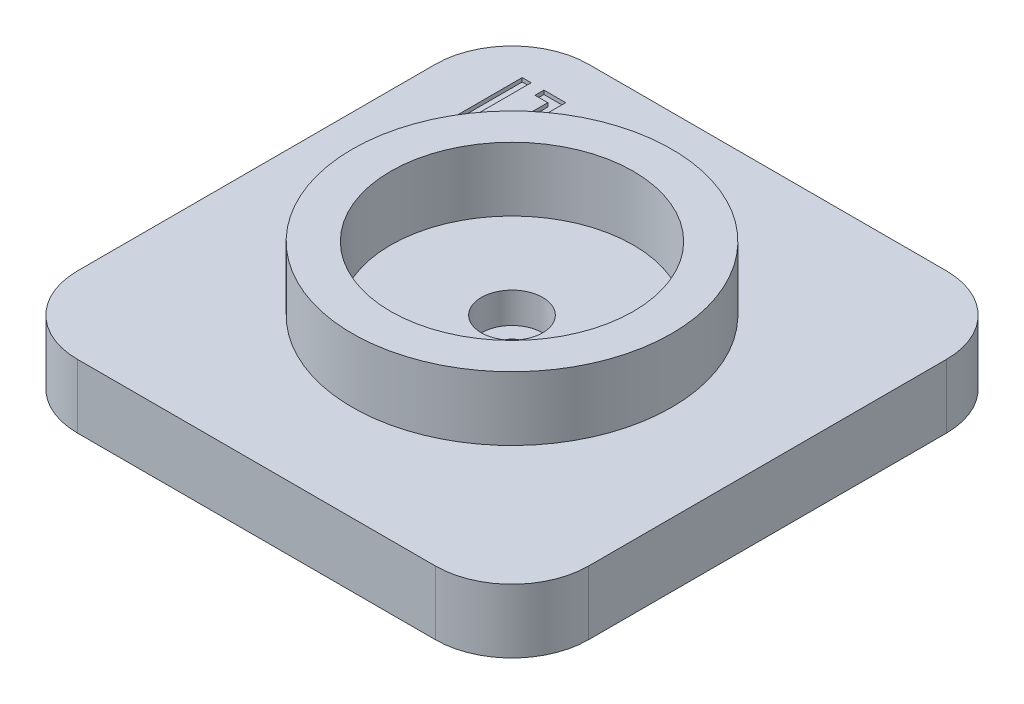
ISO-10303-21;
HEADER;
FILE_DESCRIPTION(('STEP AP214'),'2;1');
FILE_NAME('part.step','',(''),(''),'','','');
FILE_SCHEMA(('AUTOMOTIVE_DESIGN { 1 0 10303 214 1 1 1 1 }'));
ENDSEC;
DATA;
#1=APPLICATION_CONTEXT('core data for automotive mechanical design processes');
#2=APPLICATION_PROTOCOL_DEFINITION('international standard','automotive_design',2000,#1);
#3=PRODUCT_CONTEXT('',#1,'mechanical');
#4=PRODUCT('Part','Part','',(#3));
#5=PRODUCT_RELATED_PRODUCT_CATEGORY('part','',(#4));
#6=PRODUCT_DEFINITION_FORMATION('','',#4);
#7=PRODUCT_DEFINITION_CONTEXT('part definition',#1,'design');
#8=PRODUCT_DEFINITION('design','',#6,#7);
#9=PRODUCT_DEFINITION_SHAPE('','',#8);
#10=(LENGTH_UNIT() NAMED_UNIT(*) SI_UNIT(.MILLI.,.METRE.));
#11=(NAMED_UNIT(*) PLANE_ANGLE_UNIT() SI_UNIT($,.RADIAN.));
#12=(NAMED_UNIT(*) SI_UNIT($,.STERADIAN.) SOLID_ANGLE_UNIT());
#13=UNCERTAINTY_MEASURE_WITH_UNIT(LENGTH_MEASURE(1.E-05),#10,'distance_accuracy_value','');
#14=(GEOMETRIC_REPRESENTATION_CONTEXT(3) GLOBAL_UNCERTAINTY_ASSIGNED_CONTEXT((#13)) GLOBAL_UNIT_ASSIGNED_CONTEXT((#10,
#11,#12)) REPRESENTATION_CONTEXT('',''));
#15=CARTESIAN_POINT('',(0.,0.,0.));
#16=DIRECTION('',(0.,0.,1.));
#17=DIRECTION('',(1.,0.,0.));
#18=AXIS2_PLACEMENT_3D('',#15,#16,#17);
#19=CARTESIAN_POINT('',(-14.,4.,14.));
#20=DIRECTION('',(0.,1.,0.));
#21=DIRECTION('',(0.,0.,1.));
#22=AXIS2_PLACEMENT_3D('',#19,#20,#21);
#23=PLANE('',#22);
#24=CARTESIAN_POINT('',(0.,4.,0.));
#25=DIRECTION('',(0.,1.,0.));
#26=DIRECTION('',(0.,0.,1.));
#27=AXIS2_PLACEMENT_3D('',#24,#25,#26);
#28=CIRCLE('',#27,2.4);
#29=CARTESIAN_POINT('',(0.,4.,2.4));
#30=VERTEX_POINT('',#29);
#31=EDGE_CURVE('E283',#30,#30,#28,.T.);
#32=ORIENTED_EDGE('',*,*,#31,.F.);
#33=EDGE_LOOP('',(#32));
#34=FACE_BOUND('',#33,.T.);
#35=CARTESIAN_POINT('',(0.,4.,0.));
#36=DIRECTION('',(0.,1.,0.));
#37=DIRECTION('',(0.,0.,1.));
#38=AXIS2_PLACEMENT_3D('',#35,#36,#37);
#39=CIRCLE('',#38,9.5);
#40=CARTESIAN_POINT('',(0.,4.,9.5));
#41=VERTEX_POINT('',#40);
#42=EDGE_CURVE('E12',#41,#41,#39,.F.);
#43=ORIENTED_EDGE('',*,*,#42,.F.);
#44=EDGE_LOOP('',(#43));
#45=FACE_BOUND('',#44,.T.);
#46=ADVANCED_FACE('F44',(#34,#45),#23,.T.);
#47=CARTESIAN_POINT('',(-14.,-1.,14.));
#48=DIRECTION('',(0.,1.,0.));
#49=DIRECTION('',(0.,0.,1.));
#50=AXIS2_PLACEMENT_3D('',#47,#48,#49);
#51=CYLINDRICAL_SURFACE('',#50,6.);
#52=DIRECTION('',(0.,1.,0.));
#53=VECTOR('',#52,1.);
#54=CARTESIAN_POINT('',(-14.,-1.,20.));
#55=LINE('',#54,#53);
#56=CARTESIAN_POINT('',(-14.,-1.,20.));
#57=VERTEX_POINT('',#56);
#58=CARTESIAN_POINT('',(-14.,4.,20.));
#59=VERTEX_POINT('',#58);
#60=EDGE_CURVE('E345',#57,#59,#55,.T.);
#61=ORIENTED_EDGE('',*,*,#60,.T.);
#62=CARTESIAN_POINT('',(-14.,4.,14.));
#63=DIRECTION('',(0.,1.,0.));
#64=DIRECTION('',(0.,0.,1.));
#65=AXIS2_PLACEMENT_3D('',#62,#63,#64);
#66=CIRCLE('',#65,6.);
#67=CARTESIAN_POINT('',(-20.,4.,14.));
#68=VERTEX_POINT('',#67);
#69=EDGE_CURVE('E295',#68,#59,#66,.T.);
#70=ORIENTED_EDGE('',*,*,#69,.F.);
#71=DIRECTION('',(0.,1.,0.));
#72=VECTOR('',#71,1.);
#73=CARTESIAN_POINT('',(-20.,-1.,14.));
#74=LINE('',#73,#72);
#75=CARTESIAN_POINT('',(-20.,-1.,14.));
#76=VERTEX_POINT('',#75);
#77=EDGE_CURVE('E52',#76,#68,#74,.T.);
#78=ORIENTED_EDGE('',*,*,#77,.F.);
#79=CARTESIAN_POINT('',(-14.,-1.,14.));
#80=DIRECTION('',(0.,1.,0.));
#81=DIRECTION('',(0.,0.,1.));
#82=AXIS2_PLACEMENT_3D('',#79,#80,#81);
#83=CIRCLE('',#82,6.);
#84=EDGE_CURVE('E321',#76,#57,#83,.T.);
#85=ORIENTED_EDGE('',*,*,#84,.T.);
#86=EDGE_LOOP('',(#61,#70,#78,#85));
#87=FACE_BOUND('',#86,.T.);
#88=ADVANCED_FACE('F46',(#87),#51,.T.);
#89=CARTESIAN_POINT('',(-20.,-1.,-14.));
#90=DIRECTION('',(-1.,0.,0.));
#91=DIRECTION('',(0.,0.,1.));
#92=AXIS2_PLACEMENT_3D('',#89,#90,#91);
#93=PLANE('',#92);
#94=ORIENTED_EDGE('',*,*,#77,.T.);
#95=DIRECTION('',(0.,0.,1.));
#96=VECTOR('',#95,1.);
#97=CARTESIAN_POINT('',(-20.,4.,-14.));
#98=LINE('',#97,#96);
#99=CARTESIAN_POINT('',(-20.,4.,-14.));
#100=VERTEX_POINT('',#99);
#101=EDGE_CURVE('E318',#100,#68,#98,.T.);
#102=ORIENTED_EDGE('',*,*,#101,.F.);
#103=DIRECTION('',(0.,1.,0.));
#104=VECTOR('',#103,1.);
#105=CARTESIAN_POINT('',(-20.,-1.,-14.));
#106=LINE('',#105,#104);
#107=CARTESIAN_POINT('',(-20.,-1.,-14.));
#108=VERTEX_POINT('',#107);
#109=EDGE_CURVE('E347',#108,#100,#106,.T.);
#110=ORIENTED_EDGE('',*,*,#109,.F.);
#111=DIRECTION('',(0.,0.,1.));
#112=VECTOR('',#111,1.);
#113=CARTESIAN_POINT('',(-20.,-1.,-14.));
#114=LINE('',#113,#112);
#115=EDGE_CURVE('E342',#108,#76,#114,.T.);
#116=ORIENTED_EDGE('',*,*,#115,.T.);
#117=EDGE_LOOP('',(#94,#102,#110,#116));
#118=FACE_BOUND('',#117,.T.);
#119=ADVANCED_FACE('F370',(#118),#93,.T.);
#120=CARTESIAN_POINT('',(-14.,-1.,-14.));
#121=DIRECTION('',(0.,1.,0.));
#122=DIRECTION('',(0.,0.,1.));
#123=AXIS2_PLACEMENT_3D('',#120,#121,#122);
#124=CYLINDRICAL_SURFACE('',#123,6.);
#125=ORIENTED_EDGE('',*,*,#109,.T.);
#126=CARTESIAN_POINT('',(-14.,4.,-14.));
#127=DIRECTION('',(0.,1.,0.));
#128=DIRECTION('',(0.,0.,1.));
#129=AXIS2_PLACEMENT_3D('',#126,#127,#128);
#130=CIRCLE('',#129,6.);
#131=CARTESIAN_POINT('',(-14.,4.,-20.));
#132=VERTEX_POINT('',#131);
#133=EDGE_CURVE('E315',#132,#100,#130,.T.);
#134=ORIENTED_EDGE('',*,*,#133,.F.);
#135=DIRECTION('',(0.,1.,0.));
#136=VECTOR('',#135,1.);
#137=CARTESIAN_POINT('',(-14.,-1.,-20.));
#138=LINE('',#137,#136);
#139=CARTESIAN_POINT('',(-14.,-1.,-20.));
#140=VERTEX_POINT('',#139);
#141=EDGE_CURVE('E349',#140,#132,#138,.T.);
#142=ORIENTED_EDGE('',*,*,#141,.F.);
#143=CARTESIAN_POINT('',(-14.,-1.,-14.));
#144=DIRECTION('',(0.,1.,0.));
#145=DIRECTION('',(0.,0.,1.));
#146=AXIS2_PLACEMENT_3D('',#143,#144,#145);
#147=CIRCLE('',#146,6.);
#148=EDGE_CURVE('E339',#140,#108,#147,.T.);
#149=ORIENTED_EDGE('',*,*,#148,.T.);
#150=EDGE_LOOP('',(#125,#134,#142,#149));
#151=FACE_BOUND('',#150,.T.);
#152=ADVANCED_FACE('F391',(#151),#124,.T.);
#153=CARTESIAN_POINT('',(-14.,-1.,-20.));
#154=DIRECTION('',(0.,0.,-1.));
#155=DIRECTION('',(-1.,0.,0.));
#156=AXIS2_PLACEMENT_3D('',#153,#154,#155);
#157=PLANE('',#156);
#158=ORIENTED_EDGE('',*,*,#141,.T.);
#159=DIRECTION('',(-1.,0.,0.));
#160=VECTOR('',#159,1.);
#161=CARTESIAN_POINT('',(-14.,4.,-20.));
#162=LINE('',#161,#160);
#163=CARTESIAN_POINT('',(14.,4.,-20.));
#164=VERTEX_POINT('',#163);
#165=EDGE_CURVE('E312',#164,#132,#162,.T.);
#166=ORIENTED_EDGE('',*,*,#165,.F.);
#167=DIRECTION('',(0.,1.,0.));
#168=VECTOR('',#167,1.);
#169=CARTESIAN_POINT('',(14.,-1.,-20.));
#170=LINE('',#169,#168);
#171=CARTESIAN_POINT('',(14.,-1.,-20.));
#172=VERTEX_POINT('',#171);
#173=EDGE_CURVE('E351',#172,#164,#170,.T.);
#174=ORIENTED_EDGE('',*,*,#173,.F.);
#175=DIRECTION('',(-1.,0.,0.));
#176=VECTOR('',#175,1.);
#177=CARTESIAN_POINT('',(-14.,-1.,-20.));
#178=LINE('',#177,#176);
#179=EDGE_CURVE('E336',#172,#140,#178,.T.);
#180=ORIENTED_EDGE('',*,*,#179,.T.);
#181=EDGE_LOOP('',(#158,#166,#174,#180));
#182=FACE_BOUND('',#181,.T.);
#183=ADVANCED_FACE('F388',(#182),#157,.T.);
#184=CARTESIAN_POINT('',(14.,-1.,-14.));
#185=DIRECTION('',(0.,1.,0.));
#186=DIRECTION('',(0.,0.,1.));
#187=AXIS2_PLACEMENT_3D('',#184,#185,#186);
#188=CYLINDRICAL_SURFACE('',#187,6.);
#189=ORIENTED_EDGE('',*,*,#173,.T.);
#190=CARTESIAN_POINT('',(14.,4.,-14.));
#191=DIRECTION('',(0.,1.,0.));
#192=DIRECTION('',(0.,0.,-1.));
#193=AXIS2_PLACEMENT_3D('',#190,#191,#192);
#194=CIRCLE('',#193,6.);
#195=CARTESIAN_POINT('',(20.,4.,-14.));
#196=VERTEX_POINT('',#195);
#197=EDGE_CURVE('E309',#196,#164,#194,.T.);
#198=ORIENTED_EDGE('',*,*,#197,.F.);
#199=DIRECTION('',(0.,1.,0.));
#200=VECTOR('',#199,1.);
#201=CARTESIAN_POINT('',(20.,-1.,-14.));
#202=LINE('',#201,#200);
#203=CARTESIAN_POINT('',(20.,-1.,-14.));
#204=VERTEX_POINT('',#203);
#205=EDGE_CURVE('E353',#204,#196,#202,.T.);
#206=ORIENTED_EDGE('',*,*,#205,.F.);
#207=CARTESIAN_POINT('',(14.,-1.,-14.));
#208=DIRECTION('',(0.,1.,0.));
#209=DIRECTION('',(0.,0.,-1.));
#210=AXIS2_PLACEMENT_3D('',#207,#208,#209);
#211=CIRCLE('',#210,6.);
#212=EDGE_CURVE('E333',#204,#172,#211,.T.);
#213=ORIENTED_EDGE('',*,*,#212,.T.);
#214=EDGE_LOOP('',(#189,#198,#206,#213));
#215=FACE_BOUND('',#214,.T.);
#216=ADVANCED_FACE('F385',(#215),#188,.T.);
#217=CARTESIAN_POINT('',(20.,-1.,-14.));
#218=DIRECTION('',(1.,0.,0.));
#219=DIRECTION('',(0.,0.,-1.));
#220=AXIS2_PLACEMENT_3D('',#217,#218,#219);
#221=PLANE('',#220);
#222=ORIENTED_EDGE('',*,*,#205,.T.);
#223=DIRECTION('',(0.,0.,-1.));
#224=VECTOR('',#223,1.);
#225=CARTESIAN_POINT('',(20.,4.,-14.));
#226=LINE('',#225,#224);
#227=CARTESIAN_POINT('',(20.,4.,14.));
#228=VERTEX_POINT('',#227);
#229=EDGE_CURVE('E306',#228,#196,#226,.T.);
#230=ORIENTED_EDGE('',*,*,#229,.F.);
#231=DIRECTION('',(0.,1.,0.));
#232=VECTOR('',#231,1.);
#233=CARTESIAN_POINT('',(20.,-1.,14.));
#234=LINE('',#233,#232);
#235=CARTESIAN_POINT('',(20.,-1.,14.));
#236=VERTEX_POINT('',#235);
#237=EDGE_CURVE('E355',#236,#228,#234,.T.);
#238=ORIENTED_EDGE('',*,*,#237,.F.);
#239=DIRECTION('',(0.,0.,-1.));
#240=VECTOR('',#239,1.);
#241=CARTESIAN_POINT('',(20.,-1.,-14.));
#242=LINE('',#241,#240);
#243=EDGE_CURVE('E330',#236,#204,#242,.T.);
#244=ORIENTED_EDGE('',*,*,#243,.T.);
#245=EDGE_LOOP('',(#222,#230,#238,#244));
#246=FACE_BOUND('',#245,.T.);
#247=ADVANCED_FACE('F383',(#246),#221,.T.);
#248=CARTESIAN_POINT('',(14.,-1.,14.));
#249=DIRECTION('',(0.,1.,0.));
#250=DIRECTION('',(0.,0.,1.));
#251=AXIS2_PLACEMENT_3D('',#248,#249,#250);
#252=CYLINDRICAL_SURFACE('',#251,6.);
#253=ORIENTED_EDGE('',*,*,#237,.T.);
#254=CARTESIAN_POINT('',(14.,4.,14.));
#255=DIRECTION('',(0.,1.,0.));
#256=DIRECTION('',(0.,0.,1.));
#257=AXIS2_PLACEMENT_3D('',#254,#255,#256);
#258=CIRCLE('',#257,6.);
#259=CARTESIAN_POINT('',(14.,4.,20.));
#260=VERTEX_POINT('',#259);
#261=EDGE_CURVE('E303',#260,#228,#258,.T.);
#262=ORIENTED_EDGE('',*,*,#261,.F.);
#263=DIRECTION('',(0.,1.,0.));
#264=VECTOR('',#263,1.);
#265=CARTESIAN_POINT('',(14.,-1.,20.));
#266=LINE('',#265,#264);
#267=CARTESIAN_POINT('',(14.,-1.,20.));
#268=VERTEX_POINT('',#267);
#269=EDGE_CURVE('E357',#268,#260,#266,.T.);
#270=ORIENTED_EDGE('',*,*,#269,.F.);
#271=CARTESIAN_POINT('',(14.,-1.,14.));
#272=DIRECTION('',(0.,1.,0.));
#273=DIRECTION('',(0.,0.,1.));
#274=AXIS2_PLACEMENT_3D('',#271,#272,#273);
#275=CIRCLE('',#274,6.);
#276=EDGE_CURVE('E327',#268,#236,#275,.T.);
#277=ORIENTED_EDGE('',*,*,#276,.T.);
#278=EDGE_LOOP('',(#253,#262,#270,#277));
#279=FACE_BOUND('',#278,.T.);
#280=ADVANCED_FACE('F379',(#279),#252,.T.);
#281=CARTESIAN_POINT('',(-14.,-1.,20.));
#282=DIRECTION('',(0.,0.,1.));
#283=DIRECTION('',(1.,0.,0.));
#284=AXIS2_PLACEMENT_3D('',#281,#282,#283);
#285=PLANE('',#284);
#286=ORIENTED_EDGE('',*,*,#269,.T.);
#287=DIRECTION('',(1.,0.,0.));
#288=VECTOR('',#287,1.);
#289=CARTESIAN_POINT('',(-14.,4.,20.));
#290=LINE('',#289,#288);
#291=EDGE_CURVE('E300',#59,#260,#290,.T.);
#292=ORIENTED_EDGE('',*,*,#291,.F.);
#293=ORIENTED_EDGE('',*,*,#60,.F.);
#294=DIRECTION('',(1.,0.,0.));
#295=VECTOR('',#294,1.);
#296=CARTESIAN_POINT('',(-14.,-1.,20.));
#297=LINE('',#296,#295);
#298=EDGE_CURVE('E324',#57,#268,#297,.T.);
#299=ORIENTED_EDGE('',*,*,#298,.T.);
#300=EDGE_LOOP('',(#286,#292,#293,#299));
#301=FACE_BOUND('',#300,.T.);
#302=ADVANCED_FACE('F364',(#301),#285,.T.);
#303=CARTESIAN_POINT('',(-14.,-1.,14.));
#304=DIRECTION('',(0.,1.,0.));
#305=DIRECTION('',(0.,0.,1.));
#306=AXIS2_PLACEMENT_3D('',#303,#304,#305);
#307=PLANE('',#306);
#308=CARTESIAN_POINT('',(0.,-1.,0.));
#309=DIRECTION('',(0.,-1.,0.));
#310=DIRECTION('',(0.,0.,-1.));
#311=AXIS2_PLACEMENT_3D('',#308,#309,#310);
#312=CIRCLE('',#311,6.);
#313=CARTESIAN_POINT('',(0.,-1.,-6.));
#314=VERTEX_POINT('',#313);
#315=EDGE_CURVE('E289',#314,#314,#312,.T.);
#316=ORIENTED_EDGE('',*,*,#315,.F.);
#317=EDGE_LOOP('',(#316));
#318=FACE_BOUND('',#317,.T.);
#319=ORIENTED_EDGE('',*,*,#84,.F.);
#320=ORIENTED_EDGE('',*,*,#115,.F.);
#321=ORIENTED_EDGE('',*,*,#148,.F.);
#322=ORIENTED_EDGE('',*,*,#179,.F.);
#323=ORIENTED_EDGE('',*,*,#212,.F.);
#324=ORIENTED_EDGE('',*,*,#243,.F.);
#325=ORIENTED_EDGE('',*,*,#276,.F.);
#326=ORIENTED_EDGE('',*,*,#298,.F.);
#327=EDGE_LOOP('',(#319,#320,#321,#322,#323,#324,#325,#326));
#328=FACE_BOUND('',#327,.T.);
#329=ADVANCED_FACE('F373',(#318,#328),#307,.F.);
#330=DIRECTION('',(0.,0.,1.));
#331=VECTOR('',#330,1.);
#332=CARTESIAN_POINT('',(-13.,4.,-15.8));
#333=LINE('',#332,#331);
#334=CARTESIAN_POINT('',(-13.,4.,-15.8));
#335=VERTEX_POINT('',#334);
#336=CARTESIAN_POINT('',(-13.,4.,-11.5));
#337=VERTEX_POINT('',#336);
#338=EDGE_CURVE('E59',#335,#337,#333,.T.);
#339=ORIENTED_EDGE('',*,*,#338,.F.);
#340=DIRECTION('',(1.,0.,0.));
#341=VECTOR('',#340,1.);
#342=CARTESIAN_POINT('',(-14.,4.,-15.8));
#343=LINE('',#342,#341);
#344=CARTESIAN_POINT('',(-14.,4.,-15.8));
#345=VERTEX_POINT('',#344);
#346=EDGE_CURVE('E190',#345,#335,#343,.T.);
#347=ORIENTED_EDGE('',*,*,#346,.F.);
#348=DIRECTION('',(0.,0.,1.));
#349=VECTOR('',#348,1.);
#350=CARTESIAN_POINT('',(-14.,4.,-16.5));
#351=LINE('',#350,#349);
#352=CARTESIAN_POINT('',(-14.,4.,-16.5));
#353=VERTEX_POINT('',#352);
#354=EDGE_CURVE('E195',#353,#345,#351,.T.);
#355=ORIENTED_EDGE('',*,*,#354,.F.);
#356=DIRECTION('',(-1.,0.,0.));
#357=VECTOR('',#356,1.);
#358=CARTESIAN_POINT('',(-12.3,4.,-16.5));
#359=LINE('',#358,#357);
#360=CARTESIAN_POINT('',(-12.3,4.,-16.5));
#361=VERTEX_POINT('',#360);
#362=EDGE_CURVE('E724',#361,#353,#359,.T.);
#363=ORIENTED_EDGE('',*,*,#362,.F.);
#364=DIRECTION('',(0.,0.,-1.));
#365=VECTOR('',#364,1.);
#366=CARTESIAN_POINT('',(-12.3,4.,-11.5));
#367=LINE('',#366,#365);
#368=CARTESIAN_POINT('',(-12.3,4.,-11.5));
#369=VERTEX_POINT('',#368);
#370=EDGE_CURVE('E206',#369,#361,#367,.T.);
#371=ORIENTED_EDGE('',*,*,#370,.F.);
#372=DIRECTION('',(1.,0.,0.));
#373=VECTOR('',#372,1.);
#374=CARTESIAN_POINT('',(-13.,4.,-11.5));
#375=LINE('',#374,#373);
#376=EDGE_CURVE('E202',#337,#369,#375,.T.);
#377=ORIENTED_EDGE('',*,*,#376,.F.);
#378=EDGE_LOOP('',(#339,#347,#355,#363,#371,#377));
#379=FACE_BOUND('',#378,.T.);
#380=DIRECTION('',(0.,0.,-1.));
#381=VECTOR('',#380,1.);
#382=CARTESIAN_POINT('',(-15.,4.,-12.2));
#383=LINE('',#382,#381);
#384=CARTESIAN_POINT('',(-15.,4.,-12.2));
#385=VERTEX_POINT('',#384);
#386=CARTESIAN_POINT('',(-15.,4.,-16.5));
#387=VERTEX_POINT('',#386);
#388=EDGE_CURVE('E67',#385,#387,#383,.T.);
#389=ORIENTED_EDGE('',*,*,#388,.F.);
#390=DIRECTION('',(-1.,0.,0.));
#391=VECTOR('',#390,1.);
#392=CARTESIAN_POINT('',(-14.,4.,-12.2));
#393=LINE('',#392,#391);
#394=CARTESIAN_POINT('',(-14.,4.,-12.2));
#395=VERTEX_POINT('',#394);
#396=EDGE_CURVE('E230',#395,#385,#393,.T.);
#397=ORIENTED_EDGE('',*,*,#396,.F.);
#398=DIRECTION('',(0.,0.,-1.));
#399=VECTOR('',#398,1.);
#400=CARTESIAN_POINT('',(-14.,4.,-11.5));
#401=LINE('',#400,#399);
#402=CARTESIAN_POINT('',(-14.,4.,-11.5));
#403=VERTEX_POINT('',#402);
#404=EDGE_CURVE('E254',#403,#395,#401,.T.);
#405=ORIENTED_EDGE('',*,*,#404,.F.);
#406=DIRECTION('',(1.,0.,0.));
#407=VECTOR('',#406,1.);
#408=CARTESIAN_POINT('',(-15.7,4.,-11.5));
#409=LINE('',#408,#407);
#410=CARTESIAN_POINT('',(-15.7,4.,-11.5));
#411=VERTEX_POINT('',#410);
#412=EDGE_CURVE('E251',#411,#403,#409,.T.);
#413=ORIENTED_EDGE('',*,*,#412,.F.);
#414=DIRECTION('',(0.,0.,1.));
#415=VECTOR('',#414,1.);
#416=CARTESIAN_POINT('',(-15.7,4.,-16.5));
#417=LINE('',#416,#415);
#418=CARTESIAN_POINT('',(-15.7,4.,-16.5));
#419=VERTEX_POINT('',#418);
#420=EDGE_CURVE('E248',#419,#411,#417,.T.);
#421=ORIENTED_EDGE('',*,*,#420,.F.);
#422=DIRECTION('',(-1.,0.,0.));
#423=VECTOR('',#422,1.);
#424=CARTESIAN_POINT('',(-15.,4.,-16.5));
#425=LINE('',#424,#423);
#426=EDGE_CURVE('E204',#387,#419,#425,.T.);
#427=ORIENTED_EDGE('',*,*,#426,.F.);
#428=EDGE_LOOP('',(#389,#397,#405,#413,#421,#427));
#429=FACE_BOUND('',#428,.T.);
#430=CARTESIAN_POINT('',(0.,4.,0.));
#431=DIRECTION('',(0.,1.,0.));
#432=DIRECTION('',(1.,0.,0.));
#433=AXIS2_PLACEMENT_3D('',#430,#431,#432);
#434=CIRCLE('',#433,12.5);
#435=CARTESIAN_POINT('',(12.5,4.,0.));
#436=VERTEX_POINT('',#435);
#437=EDGE_CURVE('E273',#436,#436,#434,.T.);
#438=ORIENTED_EDGE('',*,*,#437,.F.);
#439=EDGE_LOOP('',(#438));
#440=FACE_BOUND('',#439,.T.);
#441=ORIENTED_EDGE('',*,*,#69,.T.);
#442=ORIENTED_EDGE('',*,*,#291,.T.);
#443=ORIENTED_EDGE('',*,*,#261,.T.);
#444=ORIENTED_EDGE('',*,*,#229,.T.);
#445=ORIENTED_EDGE('',*,*,#197,.T.);
#446=ORIENTED_EDGE('',*,*,#165,.T.);
#447=ORIENTED_EDGE('',*,*,#133,.T.);
#448=ORIENTED_EDGE('',*,*,#101,.T.);
#449=EDGE_LOOP('',(#441,#442,#443,#444,#445,#446,#447,#448));
#450=FACE_BOUND('',#449,.T.);
#451=ADVANCED_FACE('F198',(#379,#429,#440,#450),#23,.T.);
#452=CARTESIAN_POINT('',(0.,0.5,0.));
#453=DIRECTION('',(0.,-1.,0.));
#454=DIRECTION('',(0.,0.,-1.));
#455=AXIS2_PLACEMENT_3D('',#452,#453,#454);
#456=CYLINDRICAL_SURFACE('',#455,6.);
#457=CARTESIAN_POINT('',(0.,0.5,0.));
#458=DIRECTION('',(0.,-1.,0.));
#459=DIRECTION('',(0.,0.,-1.));
#460=AXIS2_PLACEMENT_3D('',#457,#458,#459);
#461=CIRCLE('',#460,6.);
#462=CARTESIAN_POINT('',(0.,0.5,-6.));
#463=VERTEX_POINT('',#462);
#464=EDGE_CURVE('E292',#463,#463,#461,.T.);
#465=ORIENTED_EDGE('',*,*,#464,.F.);
#466=EDGE_LOOP('',(#465));
#467=FACE_BOUND('',#466,.T.);
#468=ORIENTED_EDGE('',*,*,#315,.T.);
#469=EDGE_LOOP('',(#468));
#470=FACE_BOUND('',#469,.T.);
#471=ADVANCED_FACE('F411',(#467,#470),#456,.F.);
#472=CARTESIAN_POINT('',(0.,0.5,0.));
#473=DIRECTION('',(0.,-1.,0.));
#474=DIRECTION('',(0.,0.,-1.));
#475=AXIS2_PLACEMENT_3D('',#472,#473,#474);
#476=PLANE('',#475);
#477=CARTESIAN_POINT('',(0.,0.5,0.));
#478=DIRECTION('',(0.,-1.,0.));
#479=DIRECTION('',(0.,0.,-1.));
#480=AXIS2_PLACEMENT_3D('',#477,#478,#479);
#481=CIRCLE('',#480,1.1);
#482=CARTESIAN_POINT('',(0.,0.5,-1.1));
#483=VERTEX_POINT('',#482);
#484=EDGE_CURVE('E277',#483,#483,#481,.F.);
#485=ORIENTED_EDGE('',*,*,#484,.T.);
#486=EDGE_LOOP('',(#485));
#487=FACE_BOUND('',#486,.T.);
#488=ORIENTED_EDGE('',*,*,#464,.T.);
#489=EDGE_LOOP('',(#488));
#490=FACE_BOUND('',#489,.T.);
#491=ADVANCED_FACE('F417',(#487,#490),#476,.T.);
#492=CARTESIAN_POINT('',(0.,1.6,0.));
#493=DIRECTION('',(0.,1.,0.));
#494=DIRECTION('',(0.,0.,1.));
#495=AXIS2_PLACEMENT_3D('',#492,#493,#494);
#496=CYLINDRICAL_SURFACE('',#495,2.4);
#497=CARTESIAN_POINT('',(0.,1.6,0.));
#498=DIRECTION('',(0.,1.,0.));
#499=DIRECTION('',(0.,0.,1.));
#500=AXIS2_PLACEMENT_3D('',#497,#498,#499);
#501=CIRCLE('',#500,2.4);
#502=CARTESIAN_POINT('',(0.,1.6,2.4));
#503=VERTEX_POINT('',#502);
#504=EDGE_CURVE('E286',#503,#503,#501,.T.);
#505=ORIENTED_EDGE('',*,*,#504,.F.);
#506=EDGE_LOOP('',(#505));
#507=FACE_BOUND('',#506,.T.);
#508=ORIENTED_EDGE('',*,*,#31,.T.);
#509=EDGE_LOOP('',(#508));
#510=FACE_BOUND('',#509,.T.);
#511=ADVANCED_FACE('F472',(#507,#510),#496,.F.);
#512=CARTESIAN_POINT('',(0.,1.6,0.));
#513=DIRECTION('',(0.,1.,0.));
#514=DIRECTION('',(0.,0.,1.));
#515=AXIS2_PLACEMENT_3D('',#512,#513,#514);
#516=PLANE('',#515);
#517=CARTESIAN_POINT('',(0.,1.6,0.));
#518=DIRECTION('',(0.,1.,0.));
#519=DIRECTION('',(0.,0.,1.));
#520=AXIS2_PLACEMENT_3D('',#517,#518,#519);
#521=CIRCLE('',#520,1.1);
#522=CARTESIAN_POINT('',(0.,1.6,1.1));
#523=VERTEX_POINT('',#522);
#524=EDGE_CURVE('E280',#523,#523,#521,.T.);
#525=ORIENTED_EDGE('',*,*,#524,.F.);
#526=EDGE_LOOP('',(#525));
#527=FACE_BOUND('',#526,.T.);
#528=ORIENTED_EDGE('',*,*,#504,.T.);
#529=EDGE_LOOP('',(#528));
#530=FACE_BOUND('',#529,.T.);
#531=ADVANCED_FACE('F477',(#527,#530),#516,.T.);
#532=CARTESIAN_POINT('',(0.,-1.001,0.));
#533=DIRECTION('',(0.,1.,0.));
#534=DIRECTION('',(0.,0.,1.));
#535=AXIS2_PLACEMENT_3D('',#532,#533,#534);
#536=CYLINDRICAL_SURFACE('',#535,1.1);
#537=ORIENTED_EDGE('',*,*,#484,.F.);
#538=EDGE_LOOP('',(#537));
#539=FACE_BOUND('',#538,.T.);
#540=ORIENTED_EDGE('',*,*,#524,.T.);
#541=EDGE_LOOP('',(#540));
#542=FACE_BOUND('',#541,.T.);
#543=ADVANCED_FACE('F496',(#539,#542),#536,.F.);
#544=CARTESIAN_POINT('',(0.,9.,0.));
#545=DIRECTION('',(0.,1.,0.));
#546=DIRECTION('',(0.,0.,1.));
#547=AXIS2_PLACEMENT_3D('',#544,#545,#546);
#548=PLANE('',#547);
#549=CARTESIAN_POINT('',(0.,9.,0.));
#550=DIRECTION('',(0.,1.,0.));
#551=DIRECTION('',(1.,0.,0.));
#552=AXIS2_PLACEMENT_3D('',#549,#550,#551);
#553=CIRCLE('',#552,12.5);
#554=CARTESIAN_POINT('',(12.5,9.,0.));
#555=VERTEX_POINT('',#554);
#556=EDGE_CURVE('E274',#555,#555,#553,.T.);
#557=ORIENTED_EDGE('',*,*,#556,.T.);
#558=EDGE_LOOP('',(#557));
#559=FACE_BOUND('',#558,.T.);
#560=CARTESIAN_POINT('',(0.,9.,0.));
#561=DIRECTION('',(0.,1.,0.));
#562=DIRECTION('',(0.,0.,1.));
#563=AXIS2_PLACEMENT_3D('',#560,#561,#562);
#564=CIRCLE('',#563,9.5);
#565=CARTESIAN_POINT('',(0.,9.,9.5));
#566=VERTEX_POINT('',#565);
#567=EDGE_CURVE('E261',#566,#566,#564,.T.);
#568=ORIENTED_EDGE('',*,*,#567,.F.);
#569=EDGE_LOOP('',(#568));
#570=FACE_BOUND('',#569,.T.);
#571=ADVANCED_FACE('F506',(#559,#570),#548,.T.);
#572=CARTESIAN_POINT('',(0.,9.,0.));
#573=DIRECTION('',(0.,-1.,0.));
#574=DIRECTION('',(0.,0.,-1.));
#575=AXIS2_PLACEMENT_3D('',#572,#573,#574);
#576=CYLINDRICAL_SURFACE('',#575,12.5);
#577=ORIENTED_EDGE('',*,*,#556,.F.);
#578=EDGE_LOOP('',(#577));
#579=FACE_BOUND('',#578,.T.);
#580=ORIENTED_EDGE('',*,*,#437,.T.);
#581=EDGE_LOOP('',(#580));
#582=FACE_BOUND('',#581,.T.);
#583=ADVANCED_FACE('F523',(#579,#582),#576,.T.);
#584=CARTESIAN_POINT('',(0.,9.,0.));
#585=DIRECTION('',(0.,-1.,0.));
#586=DIRECTION('',(0.,0.,-1.));
#587=AXIS2_PLACEMENT_3D('',#584,#585,#586);
#588=CYLINDRICAL_SURFACE('',#587,9.5);
#589=ORIENTED_EDGE('',*,*,#567,.T.);
#590=EDGE_LOOP('',(#589));
#591=FACE_BOUND('',#590,.T.);
#592=ORIENTED_EDGE('',*,*,#42,.T.);
#593=EDGE_LOOP('',(#592));
#594=FACE_BOUND('',#593,.T.);
#595=ADVANCED_FACE('F532',(#591,#594),#588,.F.);
#596=CARTESIAN_POINT('',(-15.,3.7,-12.2));
#597=DIRECTION('',(1.,0.,0.));
#598=DIRECTION('',(0.,0.,-1.));
#599=AXIS2_PLACEMENT_3D('',#596,#597,#598);
#600=PLANE('',#599);
#601=ORIENTED_EDGE('',*,*,#388,.T.);
#602=DIRECTION('',(0.,1.,0.));
#603=VECTOR('',#602,1.);
#604=CARTESIAN_POINT('',(-15.,3.7,-16.5));
#605=LINE('',#604,#603);
#606=CARTESIAN_POINT('',(-15.,3.7,-16.5));
#607=VERTEX_POINT('',#606);
#608=EDGE_CURVE('E244',#607,#387,#605,.T.);
#609=ORIENTED_EDGE('',*,*,#608,.F.);
#610=DIRECTION('',(0.,0.,-1.));
#611=VECTOR('',#610,1.);
#612=CARTESIAN_POINT('',(-15.,3.7,-12.2));
#613=LINE('',#612,#611);
#614=CARTESIAN_POINT('',(-15.,3.7,-12.2));
#615=VERTEX_POINT('',#614);
#616=EDGE_CURVE('E226',#615,#607,#613,.T.);
#617=ORIENTED_EDGE('',*,*,#616,.F.);
#618=DIRECTION('',(0.,1.,0.));
#619=VECTOR('',#618,1.);
#620=CARTESIAN_POINT('',(-15.,3.7,-12.2));
#621=LINE('',#620,#619);
#622=EDGE_CURVE('E259',#615,#385,#621,.T.);
#623=ORIENTED_EDGE('',*,*,#622,.T.);
#624=EDGE_LOOP('',(#601,#609,#617,#623));
#625=FACE_BOUND('',#624,.T.);
#626=ADVANCED_FACE('F542',(#625),#600,.F.);
#627=CARTESIAN_POINT('',(-14.,3.7,-12.2));
#628=DIRECTION('',(0.,0.,-1.));
#629=DIRECTION('',(-1.,0.,0.));
#630=AXIS2_PLACEMENT_3D('',#627,#628,#629);
#631=PLANE('',#630);
#632=ORIENTED_EDGE('',*,*,#396,.T.);
#633=ORIENTED_EDGE('',*,*,#622,.F.);
#634=DIRECTION('',(-1.,0.,0.));
#635=VECTOR('',#634,1.);
#636=CARTESIAN_POINT('',(-14.,3.7,-12.2));
#637=LINE('',#636,#635);
#638=CARTESIAN_POINT('',(-14.,3.7,-12.2));
#639=VERTEX_POINT('',#638);
#640=EDGE_CURVE('E242',#639,#615,#637,.T.);
#641=ORIENTED_EDGE('',*,*,#640,.F.);
#642=DIRECTION('',(0.,1.,0.));
#643=VECTOR('',#642,1.);
#644=CARTESIAN_POINT('',(-14.,3.7,-12.2));
#645=LINE('',#644,#643);
#646=EDGE_CURVE('E262',#639,#395,#645,.T.);
#647=ORIENTED_EDGE('',*,*,#646,.T.);
#648=EDGE_LOOP('',(#632,#633,#641,#647));
#649=FACE_BOUND('',#648,.T.);
#650=ADVANCED_FACE('F553',(#649),#631,.F.);
#651=CARTESIAN_POINT('',(-14.,3.7,-11.5));
#652=DIRECTION('',(1.,0.,0.));
#653=DIRECTION('',(0.,0.,-1.));
#654=AXIS2_PLACEMENT_3D('',#651,#652,#653);
#655=PLANE('',#654);
#656=ORIENTED_EDGE('',*,*,#404,.T.);
#657=ORIENTED_EDGE('',*,*,#646,.F.);
#658=DIRECTION('',(0.,0.,-1.));
#659=VECTOR('',#658,1.);
#660=CARTESIAN_POINT('',(-14.,3.7,-11.5));
#661=LINE('',#660,#659);
#662=CARTESIAN_POINT('',(-14.,3.7,-11.5));
#663=VERTEX_POINT('',#662);
#664=EDGE_CURVE('E239',#663,#639,#661,.T.);
#665=ORIENTED_EDGE('',*,*,#664,.F.);
#666=DIRECTION('',(0.,1.,0.));
#667=VECTOR('',#666,1.);
#668=CARTESIAN_POINT('',(-14.,3.7,-11.5));
#669=LINE('',#668,#667);
#670=EDGE_CURVE('E264',#663,#403,#669,.T.);
#671=ORIENTED_EDGE('',*,*,#670,.T.);
#672=EDGE_LOOP('',(#656,#657,#665,#671));
#673=FACE_BOUND('',#672,.T.);
#674=ADVANCED_FACE('F559',(#673),#655,.F.);
#675=CARTESIAN_POINT('',(-15.7,3.7,-11.5));
#676=DIRECTION('',(0.,0.,1.));
#677=DIRECTION('',(1.,0.,0.));
#678=AXIS2_PLACEMENT_3D('',#675,#676,#677);
#679=PLANE('',#678);
#680=ORIENTED_EDGE('',*,*,#412,.T.);
#681=ORIENTED_EDGE('',*,*,#670,.F.);
#682=DIRECTION('',(1.,0.,0.));
#683=VECTOR('',#682,1.);
#684=CARTESIAN_POINT('',(-15.7,3.7,-11.5));
#685=LINE('',#684,#683);
#686=CARTESIAN_POINT('',(-15.7,3.7,-11.5));
#687=VERTEX_POINT('',#686);
#688=EDGE_CURVE('E236',#687,#663,#685,.T.);
#689=ORIENTED_EDGE('',*,*,#688,.F.);
#690=DIRECTION('',(0.,1.,0.));
#691=VECTOR('',#690,1.);
#692=CARTESIAN_POINT('',(-15.7,3.7,-11.5));
#693=LINE('',#692,#691);
#694=EDGE_CURVE('E266',#687,#411,#693,.T.);
#695=ORIENTED_EDGE('',*,*,#694,.T.);
#696=EDGE_LOOP('',(#680,#681,#689,#695));
#697=FACE_BOUND('',#696,.T.);
#698=ADVANCED_FACE('F567',(#697),#679,.F.);
#699=CARTESIAN_POINT('',(-15.7,3.7,-16.5));
#700=DIRECTION('',(-1.,0.,0.));
#701=DIRECTION('',(0.,0.,1.));
#702=AXIS2_PLACEMENT_3D('',#699,#700,#701);
#703=PLANE('',#702);
#704=ORIENTED_EDGE('',*,*,#420,.T.);
#705=ORIENTED_EDGE('',*,*,#694,.F.);
#706=DIRECTION('',(0.,0.,1.));
#707=VECTOR('',#706,1.);
#708=CARTESIAN_POINT('',(-15.7,3.7,-16.5));
#709=LINE('',#708,#707);
#710=CARTESIAN_POINT('',(-15.7,3.7,-16.5));
#711=VERTEX_POINT('',#710);
#712=EDGE_CURVE('E233',#711,#687,#709,.T.);
#713=ORIENTED_EDGE('',*,*,#712,.F.);
#714=DIRECTION('',(0.,1.,0.));
#715=VECTOR('',#714,1.);
#716=CARTESIAN_POINT('',(-15.7,3.7,-16.5));
#717=LINE('',#716,#715);
#718=EDGE_CURVE('E268',#711,#419,#717,.T.);
#719=ORIENTED_EDGE('',*,*,#718,.T.);
#720=EDGE_LOOP('',(#704,#705,#713,#719));
#721=FACE_BOUND('',#720,.T.);
#722=ADVANCED_FACE('F575',(#721),#703,.F.);
#723=CARTESIAN_POINT('',(-15.,3.7,-16.5));
#724=DIRECTION('',(0.,0.,-1.));
#725=DIRECTION('',(-1.,0.,0.));
#726=AXIS2_PLACEMENT_3D('',#723,#724,#725);
#727=PLANE('',#726);
#728=ORIENTED_EDGE('',*,*,#426,.T.);
#729=ORIENTED_EDGE('',*,*,#718,.F.);
#730=DIRECTION('',(-1.,0.,0.));
#731=VECTOR('',#730,1.);
#732=CARTESIAN_POINT('',(-15.,3.7,-16.5));
#733=LINE('',#732,#731);
#734=EDGE_CURVE('E229',#607,#711,#733,.T.);
#735=ORIENTED_EDGE('',*,*,#734,.F.);
#736=ORIENTED_EDGE('',*,*,#608,.T.);
#737=EDGE_LOOP('',(#728,#729,#735,#736));
#738=FACE_BOUND('',#737,.T.);
#739=ADVANCED_FACE('F583',(#738),#727,.F.);
#740=CARTESIAN_POINT('',(0.,3.7,0.));
#741=DIRECTION('',(0.,1.,0.));
#742=DIRECTION('',(0.,0.,1.));
#743=AXIS2_PLACEMENT_3D('',#740,#741,#742);
#744=PLANE('',#743);
#745=ORIENTED_EDGE('',*,*,#616,.T.);
#746=ORIENTED_EDGE('',*,*,#734,.T.);
#747=ORIENTED_EDGE('',*,*,#712,.T.);
#748=ORIENTED_EDGE('',*,*,#688,.T.);
#749=ORIENTED_EDGE('',*,*,#664,.T.);
#750=ORIENTED_EDGE('',*,*,#640,.T.);
#751=EDGE_LOOP('',(#745,#746,#747,#748,#749,#750));
#752=FACE_BOUND('',#751,.T.);
#753=ADVANCED_FACE('F591',(#752),#744,.T.);
#754=CARTESIAN_POINT('',(-13.,3.7,-15.8));
#755=DIRECTION('',(-1.,0.,0.));
#756=DIRECTION('',(0.,0.,1.));
#757=AXIS2_PLACEMENT_3D('',#754,#755,#756);
#758=PLANE('',#757);
#759=ORIENTED_EDGE('',*,*,#338,.T.);
#760=DIRECTION('',(0.,1.,0.));
#761=VECTOR('',#760,1.);
#762=CARTESIAN_POINT('',(-13.,3.7,-11.5));
#763=LINE('',#762,#761);
#764=CARTESIAN_POINT('',(-13.,3.7,-11.5));
#765=VERTEX_POINT('',#764);
#766=EDGE_CURVE('E213',#765,#337,#763,.T.);
#767=ORIENTED_EDGE('',*,*,#766,.F.);
#768=DIRECTION('',(0.,0.,1.));
#769=VECTOR('',#768,1.);
#770=CARTESIAN_POINT('',(-13.,3.7,-15.8));
#771=LINE('',#770,#769);
#772=CARTESIAN_POINT('',(-13.,3.7,-15.8));
#773=VERTEX_POINT('',#772);
#774=EDGE_CURVE('E183',#773,#765,#771,.T.);
#775=ORIENTED_EDGE('',*,*,#774,.F.);
#776=DIRECTION('',(0.,1.,0.));
#777=VECTOR('',#776,1.);
#778=CARTESIAN_POINT('',(-13.,3.7,-15.8));
#779=LINE('',#778,#777);
#780=EDGE_CURVE('E179',#773,#335,#779,.T.);
#781=ORIENTED_EDGE('',*,*,#780,.T.);
#782=EDGE_LOOP('',(#759,#767,#775,#781));
#783=FACE_BOUND('',#782,.T.);
#784=ADVANCED_FACE('F181',(#783),#758,.F.);
#785=CARTESIAN_POINT('',(-14.,3.7,-15.8));
#786=DIRECTION('',(0.,0.,1.));
#787=DIRECTION('',(1.,0.,0.));
#788=AXIS2_PLACEMENT_3D('',#785,#786,#787);
#789=PLANE('',#788);
#790=ORIENTED_EDGE('',*,*,#346,.T.);
#791=ORIENTED_EDGE('',*,*,#780,.F.);
#792=DIRECTION('',(1.,0.,0.));
#793=VECTOR('',#792,1.);
#794=CARTESIAN_POINT('',(-14.,3.7,-15.8));
#795=LINE('',#794,#793);
#796=CARTESIAN_POINT('',(-14.,3.7,-15.8));
#797=VERTEX_POINT('',#796);
#798=EDGE_CURVE('E210',#797,#773,#795,.T.);
#799=ORIENTED_EDGE('',*,*,#798,.F.);
#800=DIRECTION('',(0.,1.,0.));
#801=VECTOR('',#800,1.);
#802=CARTESIAN_POINT('',(-14.,3.7,-15.8));
#803=LINE('',#802,#801);
#804=EDGE_CURVE('E187',#797,#345,#803,.T.);
#805=ORIENTED_EDGE('',*,*,#804,.T.);
#806=EDGE_LOOP('',(#790,#791,#799,#805));
#807=FACE_BOUND('',#806,.T.);
#808=ADVANCED_FACE('F191',(#807),#789,.F.);
#809=CARTESIAN_POINT('',(-14.,3.7,-16.5));
#810=DIRECTION('',(-1.,0.,0.));
#811=DIRECTION('',(0.,0.,1.));
#812=AXIS2_PLACEMENT_3D('',#809,#810,#811);
#813=PLANE('',#812);
#814=ORIENTED_EDGE('',*,*,#354,.T.);
#815=ORIENTED_EDGE('',*,*,#804,.F.);
#816=DIRECTION('',(0.,0.,1.));
#817=VECTOR('',#816,1.);
#818=CARTESIAN_POINT('',(-14.,3.7,-16.5));
#819=LINE('',#818,#817);
#820=CARTESIAN_POINT('',(-14.,3.7,-16.5));
#821=VERTEX_POINT('',#820);
#822=EDGE_CURVE('E212',#821,#797,#819,.T.);
#823=ORIENTED_EDGE('',*,*,#822,.F.);
#824=DIRECTION('',(0.,1.,0.));
#825=VECTOR('',#824,1.);
#826=CARTESIAN_POINT('',(-14.,3.7,-16.5));
#827=LINE('',#826,#825);
#828=EDGE_CURVE('E716',#821,#353,#827,.T.);
#829=ORIENTED_EDGE('',*,*,#828,.T.);
#830=EDGE_LOOP('',(#814,#815,#823,#829));
#831=FACE_BOUND('',#830,.T.);
#832=ADVANCED_FACE('F612',(#831),#813,.F.);
#833=CARTESIAN_POINT('',(-12.3,3.7,-16.5));
#834=DIRECTION('',(0.,0.,-1.));
#835=DIRECTION('',(-1.,0.,0.));
#836=AXIS2_PLACEMENT_3D('',#833,#834,#835);
#837=PLANE('',#836);
#838=ORIENTED_EDGE('',*,*,#362,.T.);
#839=ORIENTED_EDGE('',*,*,#828,.F.);
#840=DIRECTION('',(-1.,0.,0.));
#841=VECTOR('',#840,1.);
#842=CARTESIAN_POINT('',(-12.3,3.7,-16.5));
#843=LINE('',#842,#841);
#844=CARTESIAN_POINT('',(-12.3,3.7,-16.5));
#845=VERTEX_POINT('',#844);
#846=EDGE_CURVE('E216',#845,#821,#843,.T.);
#847=ORIENTED_EDGE('',*,*,#846,.F.);
#848=DIRECTION('',(0.,1.,0.));
#849=VECTOR('',#848,1.);
#850=CARTESIAN_POINT('',(-12.3,3.7,-16.5));
#851=LINE('',#850,#849);
#852=EDGE_CURVE('E719',#845,#361,#851,.T.);
#853=ORIENTED_EDGE('',*,*,#852,.T.);
#854=EDGE_LOOP('',(#838,#839,#847,#853));
#855=FACE_BOUND('',#854,.T.);
#856=ADVANCED_FACE('F619',(#855),#837,.F.);
#857=CARTESIAN_POINT('',(-12.3,3.7,-11.5));
#858=DIRECTION('',(1.,0.,0.));
#859=DIRECTION('',(0.,0.,-1.));
#860=AXIS2_PLACEMENT_3D('',#857,#858,#859);
#861=PLANE('',#860);
#862=ORIENTED_EDGE('',*,*,#370,.T.);
#863=ORIENTED_EDGE('',*,*,#852,.F.);
#864=DIRECTION('',(0.,0.,-1.));
#865=VECTOR('',#864,1.);
#866=CARTESIAN_POINT('',(-12.3,3.7,-11.5));
#867=LINE('',#866,#865);
#868=CARTESIAN_POINT('',(-12.3,3.7,-11.5));
#869=VERTEX_POINT('',#868);
#870=EDGE_CURVE('E219',#869,#845,#867,.T.);
#871=ORIENTED_EDGE('',*,*,#870,.F.);
#872=DIRECTION('',(0.,1.,0.));
#873=VECTOR('',#872,1.);
#874=CARTESIAN_POINT('',(-12.3,3.7,-11.5));
#875=LINE('',#874,#873);
#876=EDGE_CURVE('E728',#869,#369,#875,.T.);
#877=ORIENTED_EDGE('',*,*,#876,.T.);
#878=EDGE_LOOP('',(#862,#863,#871,#877));
#879=FACE_BOUND('',#878,.T.);
#880=ADVANCED_FACE('F627',(#879),#861,.F.);
#881=CARTESIAN_POINT('',(-13.,3.7,-11.5));
#882=DIRECTION('',(0.,0.,1.));
#883=DIRECTION('',(1.,0.,0.));
#884=AXIS2_PLACEMENT_3D('',#881,#882,#883);
#885=PLANE('',#884);
#886=ORIENTED_EDGE('',*,*,#376,.T.);
#887=ORIENTED_EDGE('',*,*,#876,.F.);
#888=DIRECTION('',(1.,0.,0.));
#889=VECTOR('',#888,1.);
#890=CARTESIAN_POINT('',(-13.,3.7,-11.5));
#891=LINE('',#890,#889);
#892=EDGE_CURVE('E222',#765,#869,#891,.T.);
#893=ORIENTED_EDGE('',*,*,#892,.F.);
#894=ORIENTED_EDGE('',*,*,#766,.T.);
#895=EDGE_LOOP('',(#886,#887,#893,#894));
#896=FACE_BOUND('',#895,.T.);
#897=ADVANCED_FACE('F635',(#896),#885,.F.);
#898=CARTESIAN_POINT('',(0.,3.7,0.));
#899=DIRECTION('',(0.,1.,0.));
#900=DIRECTION('',(0.,0.,1.));
#901=AXIS2_PLACEMENT_3D('',#898,#899,#900);
#902=PLANE('',#901);
#903=ORIENTED_EDGE('',*,*,#774,.T.);
#904=ORIENTED_EDGE('',*,*,#892,.T.);
#905=ORIENTED_EDGE('',*,*,#870,.T.);
#906=ORIENTED_EDGE('',*,*,#846,.T.);
#907=ORIENTED_EDGE('',*,*,#822,.T.);
#908=ORIENTED_EDGE('',*,*,#798,.T.);
#909=EDGE_LOOP('',(#903,#904,#905,#906,#907,#908));
#910=FACE_BOUND('',#909,.T.);
#911=ADVANCED_FACE('F643',(#910),#902,.T.);
#912=CLOSED_SHELL('',(#46,#88,#119,#152,#183,#216,#247,#280,#302,#329,#451,#471,#491,#511,#531,
#543,#571,#583,#595,#626,#650,#674,#698,#722,#739,#753,#784,#808,#832,#856,#880,#897,#911));
#913=MANIFOLD_SOLID_BREP('B2',#912);
#914=ADVANCED_BREP_SHAPE_REPRESENTATION('',(#18,#913),#14);
#915=SHAPE_DEFINITION_REPRESENTATION(#9,#914);
ENDSEC;
END-ISO-10303-21;
